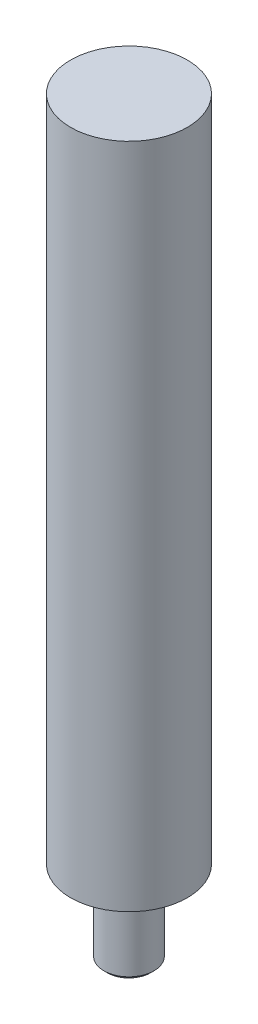
ISO-10303-21;
HEADER;
FILE_DESCRIPTION(('STEP AP214'),'2;1');
FILE_NAME('part.step','',(''),(''),'','','');
FILE_SCHEMA(('AUTOMOTIVE_DESIGN { 1 0 10303 214 1 1 1 1 }'));
ENDSEC;
DATA;
#1=APPLICATION_CONTEXT('core data for automotive mechanical design processes');
#2=APPLICATION_PROTOCOL_DEFINITION('international standard','automotive_design',2000,#1);
#3=PRODUCT_CONTEXT('',#1,'mechanical');
#4=PRODUCT('Part','Part','',(#3));
#5=PRODUCT_RELATED_PRODUCT_CATEGORY('part','',(#4));
#6=PRODUCT_DEFINITION_FORMATION('','',#4);
#7=PRODUCT_DEFINITION_CONTEXT('part definition',#1,'design');
#8=PRODUCT_DEFINITION('design','',#6,#7);
#9=PRODUCT_DEFINITION_SHAPE('','',#8);
#10=(LENGTH_UNIT() NAMED_UNIT(*) SI_UNIT(.MILLI.,.METRE.));
#11=(NAMED_UNIT(*) PLANE_ANGLE_UNIT() SI_UNIT($,.RADIAN.));
#12=(NAMED_UNIT(*) SI_UNIT($,.STERADIAN.) SOLID_ANGLE_UNIT());
#13=UNCERTAINTY_MEASURE_WITH_UNIT(LENGTH_MEASURE(1.E-05),#10,'distance_accuracy_value','');
#14=(GEOMETRIC_REPRESENTATION_CONTEXT(3) GLOBAL_UNCERTAINTY_ASSIGNED_CONTEXT((#13)) GLOBAL_UNIT_ASSIGNED_CONTEXT((#10,
#11,#12)) REPRESENTATION_CONTEXT('',''));
#15=CARTESIAN_POINT('',(0.,0.,0.));
#16=DIRECTION('',(0.,0.,1.));
#17=DIRECTION('',(1.,0.,0.));
#18=AXIS2_PLACEMENT_3D('',#15,#16,#17);
#19=CARTESIAN_POINT('',(0.,160.,0.));
#20=DIRECTION('',(0.,-1.,0.));
#21=DIRECTION('',(0.,0.,-1.));
#22=AXIS2_PLACEMENT_3D('',#19,#20,#21);
#23=CYLINDRICAL_SURFACE('',#22,14.);
#24=CARTESIAN_POINT('',(0.,160.,0.));
#25=DIRECTION('',(0.,1.,0.));
#26=DIRECTION('',(0.,0.,1.));
#27=AXIS2_PLACEMENT_3D('',#24,#25,#26);
#28=CIRCLE('',#27,14.);
#29=CARTESIAN_POINT('',(0.,160.,14.));
#30=VERTEX_POINT('',#29);
#31=EDGE_CURVE('E10',#30,#30,#28,.T.);
#32=ORIENTED_EDGE('',*,*,#31,.F.);
#33=EDGE_LOOP('',(#32));
#34=FACE_BOUND('',#33,.T.);
#35=CARTESIAN_POINT('',(0.,0.,0.));
#36=DIRECTION('',(0.,1.,0.));
#37=DIRECTION('',(0.,0.,1.));
#38=AXIS2_PLACEMENT_3D('',#35,#36,#37);
#39=CIRCLE('',#38,14.);
#40=CARTESIAN_POINT('',(0.,0.,14.));
#41=VERTEX_POINT('',#40);
#42=EDGE_CURVE('E39',#41,#41,#39,.T.);
#43=ORIENTED_EDGE('',*,*,#42,.T.);
#44=EDGE_LOOP('',(#43));
#45=FACE_BOUND('',#44,.T.);
#46=ADVANCED_FACE('F36',(#34,#45),#23,.T.);
#47=CARTESIAN_POINT('',(0.,160.,0.));
#48=DIRECTION('',(0.,1.,0.));
#49=DIRECTION('',(0.,0.,1.));
#50=AXIS2_PLACEMENT_3D('',#47,#48,#49);
#51=PLANE('',#50);
#52=ORIENTED_EDGE('',*,*,#31,.T.);
#53=EDGE_LOOP('',(#52));
#54=FACE_BOUND('',#53,.T.);
#55=ADVANCED_FACE('F73',(#54),#51,.T.);
#56=CARTESIAN_POINT('',(0.,0.,0.));
#57=DIRECTION('',(0.,1.,0.));
#58=DIRECTION('',(0.,0.,1.));
#59=AXIS2_PLACEMENT_3D('',#56,#57,#58);
#60=PLANE('',#59);
#61=ORIENTED_EDGE('',*,*,#42,.F.);
#62=EDGE_LOOP('',(#61));
#63=FACE_BOUND('',#62,.T.);
#64=CARTESIAN_POINT('',(0.,0.,0.));
#65=DIRECTION('',(0.,1.,0.));
#66=DIRECTION('',(0.,0.,1.));
#67=AXIS2_PLACEMENT_3D('',#64,#65,#66);
#68=CIRCLE('',#67,6.);
#69=CARTESIAN_POINT('',(0.,0.,6.));
#70=VERTEX_POINT('',#69);
#71=EDGE_CURVE('E46',#70,#70,#68,.T.);
#72=ORIENTED_EDGE('',*,*,#71,.T.);
#73=EDGE_LOOP('',(#72));
#74=FACE_BOUND('',#73,.T.);
#75=ADVANCED_FACE('F78',(#63,#74),#60,.F.);
#76=CARTESIAN_POINT('',(0.,-20.,0.));
#77=DIRECTION('',(0.,1.,0.));
#78=DIRECTION('',(0.,0.,1.));
#79=AXIS2_PLACEMENT_3D('',#76,#77,#78);
#80=CYLINDRICAL_SURFACE('',#79,6.);
#81=ORIENTED_EDGE('',*,*,#71,.F.);
#82=EDGE_LOOP('',(#81));
#83=FACE_BOUND('',#82,.T.);
#84=CARTESIAN_POINT('',(0.,-19.172,0.));
#85=DIRECTION('',(0.,1.,0.));
#86=DIRECTION('',(0.,0.,1.));
#87=AXIS2_PLACEMENT_3D('',#84,#85,#86);
#88=CIRCLE('',#87,6.);
#89=CARTESIAN_POINT('',(0.,-19.172,6.));
#90=VERTEX_POINT('',#89);
#91=EDGE_CURVE('E53',#90,#90,#88,.T.);
#92=ORIENTED_EDGE('',*,*,#91,.T.);
#93=EDGE_LOOP('',(#92));
#94=FACE_BOUND('',#93,.T.);
#95=ADVANCED_FACE('F57',(#83,#94),#80,.T.);
#96=CARTESIAN_POINT('',(0.,-20.,0.));
#97=DIRECTION('',(0.,1.,0.));
#98=DIRECTION('',(0.,0.,1.));
#99=AXIS2_PLACEMENT_3D('',#96,#97,#98);
#100=CONICAL_SURFACE('',#99,5.172,0.785398163397455);
#101=ORIENTED_EDGE('',*,*,#91,.F.);
#102=EDGE_LOOP('',(#101));
#103=FACE_BOUND('',#102,.T.);
#104=CARTESIAN_POINT('',(0.,-20.,0.));
#105=DIRECTION('',(0.,1.,0.));
#106=DIRECTION('',(0.,0.,1.));
#107=AXIS2_PLACEMENT_3D('',#104,#105,#106);
#108=CIRCLE('',#107,5.172);
#109=CARTESIAN_POINT('',(0.,-20.,5.172));
#110=VERTEX_POINT('',#109);
#111=EDGE_CURVE('E50',#110,#110,#108,.T.);
#112=ORIENTED_EDGE('',*,*,#111,.T.);
#113=EDGE_LOOP('',(#112));
#114=FACE_BOUND('',#113,.T.);
#115=ADVANCED_FACE('F59',(#103,#114),#100,.T.);
#116=CARTESIAN_POINT('',(0.,-20.,0.));
#117=DIRECTION('',(0.,-1.,0.));
#118=DIRECTION('',(0.,0.,-1.));
#119=AXIS2_PLACEMENT_3D('',#116,#117,#118);
#120=PLANE('',#119);
#121=ORIENTED_EDGE('',*,*,#111,.F.);
#122=EDGE_LOOP('',(#121));
#123=FACE_BOUND('',#122,.T.);
#124=ADVANCED_FACE('F62',(#123),#120,.T.);
#125=CLOSED_SHELL('',(#46,#55,#75,#95,#115,#124));
#126=MANIFOLD_SOLID_BREP('B2',#125);
#127=ADVANCED_BREP_SHAPE_REPRESENTATION('',(#18,#126),#14);
#128=SHAPE_DEFINITION_REPRESENTATION(#9,#127);
ENDSEC;
END-ISO-10303-21;
